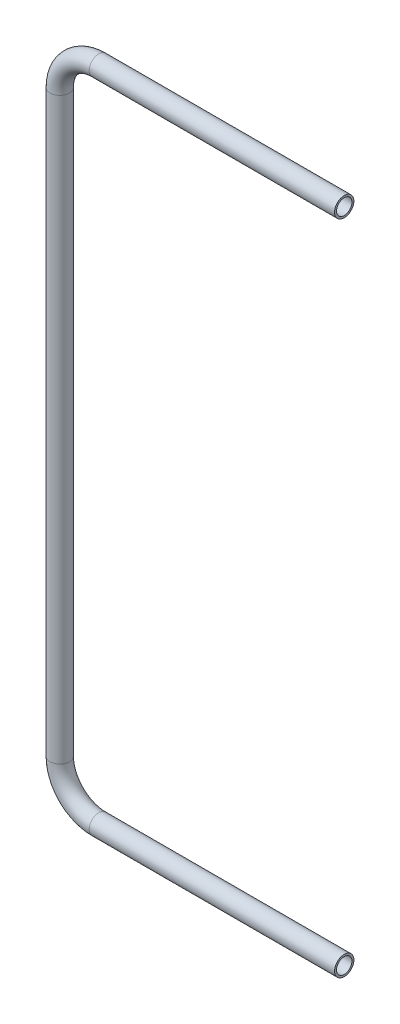
ISO-10303-21;
HEADER;
FILE_DESCRIPTION(('STEP AP214'),'2;1');
FILE_NAME('part.step','',(''),(''),'','','');
FILE_SCHEMA(('AUTOMOTIVE_DESIGN { 1 0 10303 214 1 1 1 1 }'));
ENDSEC;
DATA;
#1=APPLICATION_CONTEXT('core data for automotive mechanical design processes');
#2=APPLICATION_PROTOCOL_DEFINITION('international standard','automotive_design',2000,#1);
#3=PRODUCT_CONTEXT('',#1,'mechanical');
#4=PRODUCT('Part','Part','',(#3));
#5=PRODUCT_RELATED_PRODUCT_CATEGORY('part','',(#4));
#6=PRODUCT_DEFINITION_FORMATION('','',#4);
#7=PRODUCT_DEFINITION_CONTEXT('part definition',#1,'design');
#8=PRODUCT_DEFINITION('design','',#6,#7);
#9=PRODUCT_DEFINITION_SHAPE('','',#8);
#10=(LENGTH_UNIT() NAMED_UNIT(*) SI_UNIT(.MILLI.,.METRE.));
#11=(NAMED_UNIT(*) PLANE_ANGLE_UNIT() SI_UNIT($,.RADIAN.));
#12=(NAMED_UNIT(*) SI_UNIT($,.STERADIAN.) SOLID_ANGLE_UNIT());
#13=UNCERTAINTY_MEASURE_WITH_UNIT(LENGTH_MEASURE(1.E-05),#10,'distance_accuracy_value','');
#14=(GEOMETRIC_REPRESENTATION_CONTEXT(3) GLOBAL_UNCERTAINTY_ASSIGNED_CONTEXT((#13)) GLOBAL_UNIT_ASSIGNED_CONTEXT((#10,
#11,#12)) REPRESENTATION_CONTEXT('',''));
#15=CARTESIAN_POINT('',(0.,0.,0.));
#16=DIRECTION('',(0.,0.,1.));
#17=DIRECTION('',(1.,0.,0.));
#18=AXIS2_PLACEMENT_3D('',#15,#16,#17);
#19=CARTESIAN_POINT('',(0.,0.,0.));
#20=DIRECTION('',(-1.,0.,0.));
#21=DIRECTION('',(0.,-1.,0.));
#22=AXIS2_PLACEMENT_3D('',#19,#20,#21);
#23=CYLINDRICAL_SURFACE('',#22,16.7005);
#24=CARTESIAN_POINT('',(-423.799,0.,0.));
#25=DIRECTION('',(1.,0.,0.));
#26=DIRECTION('',(0.,0.,-1.));
#27=AXIS2_PLACEMENT_3D('',#24,#25,#26);
#28=CIRCLE('',#27,16.7005);
#29=CARTESIAN_POINT('',(-423.799,-16.7005000000001,0.));
#30=VERTEX_POINT('',#29);
#31=EDGE_CURVE('E115',#30,#30,#28,.T.);
#32=ORIENTED_EDGE('',*,*,#31,.T.);
#33=EDGE_LOOP('',(#32));
#34=FACE_BOUND('',#33,.T.);
#35=CARTESIAN_POINT('',(0.,0.,0.));
#36=DIRECTION('',(1.,0.,0.));
#37=DIRECTION('',(0.,0.,-1.));
#38=AXIS2_PLACEMENT_3D('',#35,#36,#37);
#39=CIRCLE('',#38,16.7005);
#40=CARTESIAN_POINT('',(0.,0.,-16.7005));
#41=VERTEX_POINT('',#40);
#42=EDGE_CURVE('E49',#41,#41,#39,.T.);
#43=ORIENTED_EDGE('',*,*,#42,.F.);
#44=EDGE_LOOP('',(#43));
#45=FACE_BOUND('',#44,.T.);
#46=ADVANCED_FACE('F34',(#34,#45),#23,.T.);
#47=CARTESIAN_POINT('',(-423.799,67.5005,0.));
#48=DIRECTION('',(0.,0.,-1.));
#49=DIRECTION('',(-1.,0.,0.));
#50=AXIS2_PLACEMENT_3D('',#47,#48,#49);
#51=TOROIDAL_SURFACE('',#50,67.5005,16.7005);
#52=CARTESIAN_POINT('',(-491.2995,67.5005,0.));
#53=DIRECTION('',(0.,-1.,0.));
#54=DIRECTION('',(0.,0.,-1.));
#55=AXIS2_PLACEMENT_3D('',#52,#53,#54);
#56=CIRCLE('',#55,16.7005);
#57=CARTESIAN_POINT('',(-508.,67.5005,0.));
#58=VERTEX_POINT('',#57);
#59=EDGE_CURVE('E118',#58,#58,#56,.T.);
#60=CARTESIAN_POINT('',(-423.799,67.5005,0.));
#61=DIRECTION('',(0.,0.,-1.));
#62=DIRECTION('',(-1.,0.,0.));
#63=AXIS2_PLACEMENT_3D('',#60,#61,#62);
#64=CIRCLE('',#63,84.201);
#65=EDGE_CURVE('',#30,#58,#64,.T.);
#66=ORIENTED_EDGE('',*,*,#31,.F.);
#67=ORIENTED_EDGE('',*,*,#59,.T.);
#68=ORIENTED_EDGE('',*,*,#65,.T.);
#69=ORIENTED_EDGE('',*,*,#65,.F.);
#70=EDGE_LOOP('',(#66,#68,#67,#69));
#71=FACE_BOUND('',#70,.T.);
#72=ADVANCED_FACE('F139',(#71),#51,.T.);
#73=CARTESIAN_POINT('',(-491.2995,67.5005,0.));
#74=DIRECTION('',(0.,1.,0.));
#75=DIRECTION('',(-1.,0.,0.));
#76=AXIS2_PLACEMENT_3D('',#73,#74,#75);
#77=CYLINDRICAL_SURFACE('',#76,16.7005);
#78=CARTESIAN_POINT('',(-491.2995,1067.562,0.));
#79=DIRECTION('',(0.,-1.,0.));
#80=DIRECTION('',(0.,0.,-1.));
#81=AXIS2_PLACEMENT_3D('',#78,#79,#80);
#82=CIRCLE('',#81,16.7005);
#83=CARTESIAN_POINT('',(-508.,1067.562,0.));
#84=VERTEX_POINT('',#83);
#85=EDGE_CURVE('E120',#84,#84,#82,.T.);
#86=ORIENTED_EDGE('',*,*,#85,.T.);
#87=EDGE_LOOP('',(#86));
#88=FACE_BOUND('',#87,.T.);
#89=ORIENTED_EDGE('',*,*,#59,.F.);
#90=EDGE_LOOP('',(#89));
#91=FACE_BOUND('',#90,.T.);
#92=ADVANCED_FACE('F135',(#88,#91),#77,.T.);
#93=CARTESIAN_POINT('',(-423.799,1067.562,0.));
#94=DIRECTION('',(0.,0.,-1.));
#95=DIRECTION('',(-1.,0.,0.));
#96=AXIS2_PLACEMENT_3D('',#93,#94,#95);
#97=TOROIDAL_SURFACE('',#96,67.5005,16.7005);
#98=CARTESIAN_POINT('',(-423.799,1135.0625,0.));
#99=DIRECTION('',(-1.,0.,0.));
#100=DIRECTION('',(0.,0.,-1.));
#101=AXIS2_PLACEMENT_3D('',#98,#99,#100);
#102=CIRCLE('',#101,16.7005);
#103=CARTESIAN_POINT('',(-423.799,1151.763,0.));
#104=VERTEX_POINT('',#103);
#105=EDGE_CURVE('E38',#104,#104,#102,.T.);
#106=CARTESIAN_POINT('',(-423.799,1067.562,0.));
#107=DIRECTION('',(0.,0.,-1.));
#108=DIRECTION('',(-1.,0.,0.));
#109=AXIS2_PLACEMENT_3D('',#106,#107,#108);
#110=CIRCLE('',#109,84.201);
#111=EDGE_CURVE('',#84,#104,#110,.T.);
#112=ORIENTED_EDGE('',*,*,#85,.F.);
#113=ORIENTED_EDGE('',*,*,#105,.T.);
#114=ORIENTED_EDGE('',*,*,#111,.T.);
#115=ORIENTED_EDGE('',*,*,#111,.F.);
#116=EDGE_LOOP('',(#112,#114,#113,#115));
#117=FACE_BOUND('',#116,.T.);
#118=ADVANCED_FACE('F127',(#117),#97,.T.);
#119=CARTESIAN_POINT('',(-423.799,1135.0625,0.));
#120=DIRECTION('',(1.,0.,0.));
#121=DIRECTION('',(0.,0.,-1.));
#122=AXIS2_PLACEMENT_3D('',#119,#120,#121);
#123=CYLINDRICAL_SURFACE('',#122,16.7005);
#124=CARTESIAN_POINT('',(-3.33066907387547E-13,1135.0625,0.));
#125=DIRECTION('',(-1.,0.,0.));
#126=DIRECTION('',(0.,0.,-1.));
#127=AXIS2_PLACEMENT_3D('',#124,#125,#126);
#128=CIRCLE('',#127,16.7005);
#129=CARTESIAN_POINT('',(-3.33066907387547E-13,1135.0625,-16.7005));
#130=VERTEX_POINT('',#129);
#131=EDGE_CURVE('E54',#130,#130,#128,.T.);
#132=ORIENTED_EDGE('',*,*,#131,.T.);
#133=EDGE_LOOP('',(#132));
#134=FACE_BOUND('',#133,.T.);
#135=ORIENTED_EDGE('',*,*,#105,.F.);
#136=EDGE_LOOP('',(#135));
#137=FACE_BOUND('',#136,.T.);
#138=ADVANCED_FACE('F36',(#134,#137),#123,.T.);
#139=CARTESIAN_POINT('',(0.,0.,0.));
#140=DIRECTION('',(1.,0.,0.));
#141=DIRECTION('',(0.,0.,-1.));
#142=AXIS2_PLACEMENT_3D('',#139,#140,#141);
#143=PLANE('',#142);
#144=CARTESIAN_POINT('',(0.,0.,0.));
#145=DIRECTION('',(1.,0.,0.));
#146=DIRECTION('',(0.,0.,-1.));
#147=AXIS2_PLACEMENT_3D('',#144,#145,#146);
#148=CIRCLE('',#147,13.335);
#149=CARTESIAN_POINT('',(0.,0.,-13.335));
#150=VERTEX_POINT('',#149);
#151=EDGE_CURVE('E102',#150,#150,#148,.F.);
#152=ORIENTED_EDGE('',*,*,#151,.T.);
#153=EDGE_LOOP('',(#152));
#154=FACE_BOUND('',#153,.T.);
#155=ORIENTED_EDGE('',*,*,#42,.T.);
#156=EDGE_LOOP('',(#155));
#157=FACE_BOUND('',#156,.T.);
#158=ADVANCED_FACE('F67',(#154,#157),#143,.T.);
#159=CARTESIAN_POINT('',(-3.33066907387547E-13,1135.0625,0.));
#160=DIRECTION('',(-1.,0.,0.));
#161=DIRECTION('',(0.,0.,-1.));
#162=AXIS2_PLACEMENT_3D('',#159,#160,#161);
#163=PLANE('',#162);
#164=CARTESIAN_POINT('',(-3.33066907387547E-13,1135.0625,0.));
#165=DIRECTION('',(-1.,0.,0.));
#166=DIRECTION('',(0.,0.,-1.));
#167=AXIS2_PLACEMENT_3D('',#164,#165,#166);
#168=CIRCLE('',#167,13.335);
#169=CARTESIAN_POINT('',(-3.33066907387547E-13,1135.0625,-13.335));
#170=VERTEX_POINT('',#169);
#171=EDGE_CURVE('E11',#170,#170,#168,.F.);
#172=ORIENTED_EDGE('',*,*,#171,.F.);
#173=EDGE_LOOP('',(#172));
#174=FACE_BOUND('',#173,.T.);
#175=ORIENTED_EDGE('',*,*,#131,.F.);
#176=EDGE_LOOP('',(#175));
#177=FACE_BOUND('',#176,.T.);
#178=ADVANCED_FACE('F64',(#174,#177),#163,.F.);
#179=CARTESIAN_POINT('',(0.,0.,0.));
#180=DIRECTION('',(-1.,0.,0.));
#181=DIRECTION('',(0.,-1.,0.));
#182=AXIS2_PLACEMENT_3D('',#179,#180,#181);
#183=CYLINDRICAL_SURFACE('',#182,13.335);
#184=CARTESIAN_POINT('',(-423.799,0.,0.));
#185=DIRECTION('',(1.,0.,0.));
#186=DIRECTION('',(0.,0.,-1.));
#187=AXIS2_PLACEMENT_3D('',#184,#185,#186);
#188=CIRCLE('',#187,13.335);
#189=CARTESIAN_POINT('',(-423.799,-13.3350000000001,0.));
#190=VERTEX_POINT('',#189);
#191=EDGE_CURVE('E101',#190,#190,#188,.F.);
#192=ORIENTED_EDGE('',*,*,#191,.T.);
#193=EDGE_LOOP('',(#192));
#194=FACE_BOUND('',#193,.T.);
#195=ORIENTED_EDGE('',*,*,#151,.F.);
#196=EDGE_LOOP('',(#195));
#197=FACE_BOUND('',#196,.T.);
#198=ADVANCED_FACE('F66',(#194,#197),#183,.F.);
#199=CARTESIAN_POINT('',(-423.799,67.5005,0.));
#200=DIRECTION('',(0.,0.,-1.));
#201=DIRECTION('',(-1.,0.,0.));
#202=AXIS2_PLACEMENT_3D('',#199,#200,#201);
#203=TOROIDAL_SURFACE('',#202,67.5005,13.335);
#204=CARTESIAN_POINT('',(-491.2995,67.5005,0.));
#205=DIRECTION('',(0.,-1.,0.));
#206=DIRECTION('',(0.,0.,-1.));
#207=AXIS2_PLACEMENT_3D('',#204,#205,#206);
#208=CIRCLE('',#207,13.335);
#209=CARTESIAN_POINT('',(-504.6345,67.5005,0.));
#210=VERTEX_POINT('',#209);
#211=EDGE_CURVE('E98',#210,#210,#208,.F.);
#212=CARTESIAN_POINT('',(-423.799,67.5005,0.));
#213=DIRECTION('',(0.,0.,-1.));
#214=DIRECTION('',(-1.,0.,0.));
#215=AXIS2_PLACEMENT_3D('',#212,#213,#214);
#216=CIRCLE('',#215,80.8355);
#217=EDGE_CURVE('',#190,#210,#216,.T.);
#218=ORIENTED_EDGE('',*,*,#191,.F.);
#219=ORIENTED_EDGE('',*,*,#211,.T.);
#220=ORIENTED_EDGE('',*,*,#217,.T.);
#221=ORIENTED_EDGE('',*,*,#217,.F.);
#222=EDGE_LOOP('',(#218,#220,#219,#221));
#223=FACE_BOUND('',#222,.T.);
#224=ADVANCED_FACE('F73',(#223),#203,.F.);
#225=CARTESIAN_POINT('',(-491.2995,67.5005,0.));
#226=DIRECTION('',(0.,1.,0.));
#227=DIRECTION('',(-1.,0.,0.));
#228=AXIS2_PLACEMENT_3D('',#225,#226,#227);
#229=CYLINDRICAL_SURFACE('',#228,13.335);
#230=CARTESIAN_POINT('',(-491.2995,1067.562,0.));
#231=DIRECTION('',(0.,-1.,0.));
#232=DIRECTION('',(0.,0.,-1.));
#233=AXIS2_PLACEMENT_3D('',#230,#231,#232);
#234=CIRCLE('',#233,13.335);
#235=CARTESIAN_POINT('',(-504.6345,1067.562,0.));
#236=VERTEX_POINT('',#235);
#237=EDGE_CURVE('E104',#236,#236,#234,.F.);
#238=ORIENTED_EDGE('',*,*,#237,.T.);
#239=EDGE_LOOP('',(#238));
#240=FACE_BOUND('',#239,.T.);
#241=ORIENTED_EDGE('',*,*,#211,.F.);
#242=EDGE_LOOP('',(#241));
#243=FACE_BOUND('',#242,.T.);
#244=ADVANCED_FACE('F84',(#240,#243),#229,.F.);
#245=CARTESIAN_POINT('',(-423.799,1067.562,0.));
#246=DIRECTION('',(0.,0.,-1.));
#247=DIRECTION('',(-1.,0.,0.));
#248=AXIS2_PLACEMENT_3D('',#245,#246,#247);
#249=TOROIDAL_SURFACE('',#248,67.5005,13.335);
#250=CARTESIAN_POINT('',(-423.799,1135.0625,0.));
#251=DIRECTION('',(-1.,0.,0.));
#252=DIRECTION('',(0.,0.,-1.));
#253=AXIS2_PLACEMENT_3D('',#250,#251,#252);
#254=CIRCLE('',#253,13.335);
#255=CARTESIAN_POINT('',(-423.799,1148.3975,0.));
#256=VERTEX_POINT('',#255);
#257=EDGE_CURVE('E43',#256,#256,#254,.F.);
#258=CARTESIAN_POINT('',(-423.799,1067.562,0.));
#259=DIRECTION('',(0.,0.,-1.));
#260=DIRECTION('',(-1.,0.,0.));
#261=AXIS2_PLACEMENT_3D('',#258,#259,#260);
#262=CIRCLE('',#261,80.8355);
#263=EDGE_CURVE('',#236,#256,#262,.T.);
#264=ORIENTED_EDGE('',*,*,#237,.F.);
#265=ORIENTED_EDGE('',*,*,#257,.T.);
#266=ORIENTED_EDGE('',*,*,#263,.T.);
#267=ORIENTED_EDGE('',*,*,#263,.F.);
#268=EDGE_LOOP('',(#264,#266,#265,#267));
#269=FACE_BOUND('',#268,.T.);
#270=ADVANCED_FACE('F80',(#269),#249,.F.);
#271=CARTESIAN_POINT('',(-423.799,1135.0625,0.));
#272=DIRECTION('',(1.,0.,0.));
#273=DIRECTION('',(0.,0.,-1.));
#274=AXIS2_PLACEMENT_3D('',#271,#272,#273);
#275=CYLINDRICAL_SURFACE('',#274,13.335);
#276=ORIENTED_EDGE('',*,*,#171,.T.);
#277=EDGE_LOOP('',(#276));
#278=FACE_BOUND('',#277,.T.);
#279=ORIENTED_EDGE('',*,*,#257,.F.);
#280=EDGE_LOOP('',(#279));
#281=FACE_BOUND('',#280,.T.);
#282=ADVANCED_FACE('F61',(#278,#281),#275,.F.);
#283=CLOSED_SHELL('',(#46,#72,#92,#118,#138,#158,#178,#198,#224,#244,#270,#282));
#284=MANIFOLD_SOLID_BREP('B2',#283);
#285=ADVANCED_BREP_SHAPE_REPRESENTATION('',(#18,#284),#14);
#286=SHAPE_DEFINITION_REPRESENTATION(#9,#285);
ENDSEC;
END-ISO-10303-21;
